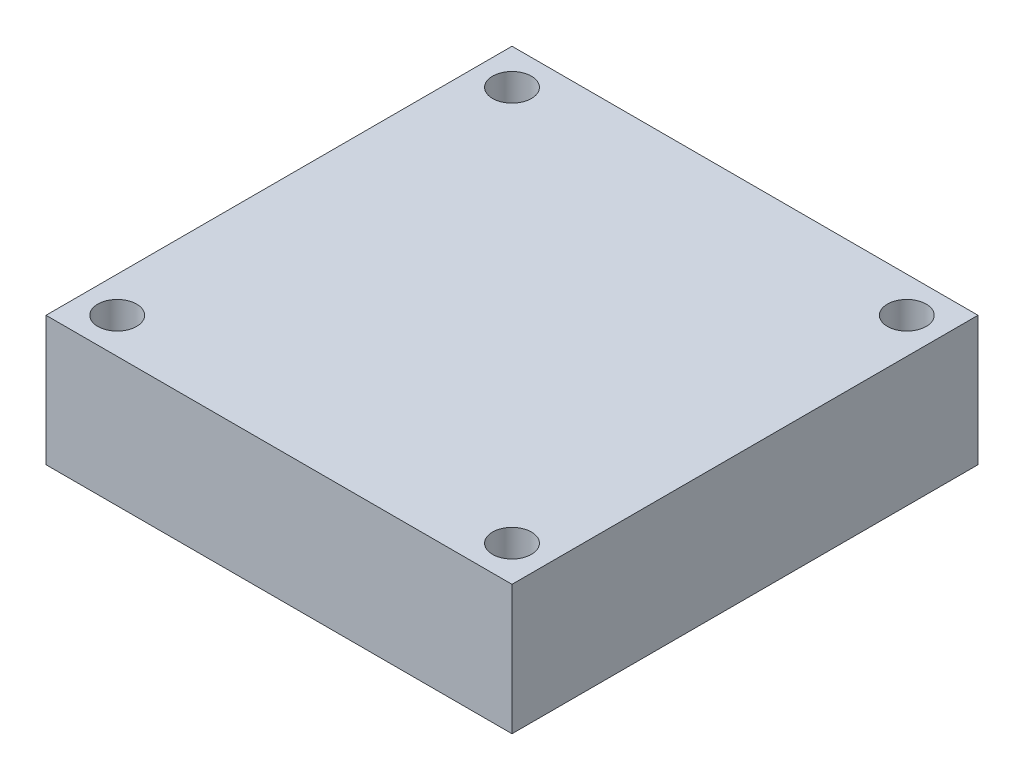
ISO-10303-21;
HEADER;
FILE_DESCRIPTION(('STEP AP214'),'2;1');
FILE_NAME('part.step','',(''),(''),'','','');
FILE_SCHEMA(('AUTOMOTIVE_DESIGN { 1 0 10303 214 1 1 1 1 }'));
ENDSEC;
DATA;
#1=APPLICATION_CONTEXT('core data for automotive mechanical design processes');
#2=APPLICATION_PROTOCOL_DEFINITION('international standard','automotive_design',2000,#1);
#3=PRODUCT_CONTEXT('',#1,'mechanical');
#4=PRODUCT('Part','Part','',(#3));
#5=PRODUCT_RELATED_PRODUCT_CATEGORY('part','',(#4));
#6=PRODUCT_DEFINITION_FORMATION('','',#4);
#7=PRODUCT_DEFINITION_CONTEXT('part definition',#1,'design');
#8=PRODUCT_DEFINITION('design','',#6,#7);
#9=PRODUCT_DEFINITION_SHAPE('','',#8);
#10=(LENGTH_UNIT() NAMED_UNIT(*) SI_UNIT(.MILLI.,.METRE.));
#11=(NAMED_UNIT(*) PLANE_ANGLE_UNIT() SI_UNIT($,.RADIAN.));
#12=(NAMED_UNIT(*) SI_UNIT($,.STERADIAN.) SOLID_ANGLE_UNIT());
#13=UNCERTAINTY_MEASURE_WITH_UNIT(LENGTH_MEASURE(1.E-05),#10,'distance_accuracy_value','');
#14=(GEOMETRIC_REPRESENTATION_CONTEXT(3) GLOBAL_UNCERTAINTY_ASSIGNED_CONTEXT((#13)) GLOBAL_UNIT_ASSIGNED_CONTEXT((#10,
#11,#12)) REPRESENTATION_CONTEXT('',''));
#15=CARTESIAN_POINT('',(0.,0.,0.));
#16=DIRECTION('',(0.,0.,1.));
#17=DIRECTION('',(1.,0.,0.));
#18=AXIS2_PLACEMENT_3D('',#15,#16,#17);
#19=CARTESIAN_POINT('',(-18.,10.,18.));
#20=DIRECTION('',(1.,0.,0.));
#21=DIRECTION('',(0.,0.,-1.));
#22=AXIS2_PLACEMENT_3D('',#19,#20,#21);
#23=PLANE('',#22);
#24=DIRECTION('',(0.,0.,1.));
#25=VECTOR('',#24,1.);
#26=CARTESIAN_POINT('',(-18.,0.,18.));
#27=LINE('',#26,#25);
#28=CARTESIAN_POINT('',(-18.,0.,-18.));
#29=VERTEX_POINT('',#28);
#30=CARTESIAN_POINT('',(-18.,0.,18.));
#31=VERTEX_POINT('',#30);
#32=EDGE_CURVE('E98',#29,#31,#27,.T.);
#33=ORIENTED_EDGE('',*,*,#32,.T.);
#34=DIRECTION('',(0.,-1.,0.));
#35=VECTOR('',#34,1.);
#36=CARTESIAN_POINT('',(-18.,10.,18.));
#37=LINE('',#36,#35);
#38=CARTESIAN_POINT('',(-18.,10.,18.));
#39=VERTEX_POINT('',#38);
#40=EDGE_CURVE('E11',#39,#31,#37,.T.);
#41=ORIENTED_EDGE('',*,*,#40,.F.);
#42=DIRECTION('',(0.,0.,1.));
#43=VECTOR('',#42,1.);
#44=CARTESIAN_POINT('',(-18.,10.,18.));
#45=LINE('',#44,#43);
#46=CARTESIAN_POINT('',(-18.,10.,-18.));
#47=VERTEX_POINT('',#46);
#48=EDGE_CURVE('E86',#47,#39,#45,.T.);
#49=ORIENTED_EDGE('',*,*,#48,.F.);
#50=DIRECTION('',(0.,-1.,0.));
#51=VECTOR('',#50,1.);
#52=CARTESIAN_POINT('',(-18.,10.,-18.));
#53=LINE('',#52,#51);
#54=EDGE_CURVE('E94',#47,#29,#53,.T.);
#55=ORIENTED_EDGE('',*,*,#54,.T.);
#56=EDGE_LOOP('',(#33,#41,#49,#55));
#57=FACE_BOUND('',#56,.T.);
#58=ADVANCED_FACE('F35',(#57),#23,.F.);
#59=CARTESIAN_POINT('',(-18.,10.,18.));
#60=DIRECTION('',(0.,0.,-1.));
#61=DIRECTION('',(-1.,0.,0.));
#62=AXIS2_PLACEMENT_3D('',#59,#60,#61);
#63=PLANE('',#62);
#64=DIRECTION('',(1.,0.,0.));
#65=VECTOR('',#64,1.);
#66=CARTESIAN_POINT('',(-18.,0.,18.));
#67=LINE('',#66,#65);
#68=CARTESIAN_POINT('',(18.,0.,18.));
#69=VERTEX_POINT('',#68);
#70=EDGE_CURVE('E90',#31,#69,#67,.T.);
#71=ORIENTED_EDGE('',*,*,#70,.T.);
#72=DIRECTION('',(0.,-1.,0.));
#73=VECTOR('',#72,1.);
#74=CARTESIAN_POINT('',(18.,10.,18.));
#75=LINE('',#74,#73);
#76=CARTESIAN_POINT('',(18.,10.,18.));
#77=VERTEX_POINT('',#76);
#78=EDGE_CURVE('E43',#77,#69,#75,.T.);
#79=ORIENTED_EDGE('',*,*,#78,.F.);
#80=DIRECTION('',(1.,0.,0.));
#81=VECTOR('',#80,1.);
#82=CARTESIAN_POINT('',(-18.,10.,18.));
#83=LINE('',#82,#81);
#84=EDGE_CURVE('E81',#39,#77,#83,.T.);
#85=ORIENTED_EDGE('',*,*,#84,.F.);
#86=ORIENTED_EDGE('',*,*,#40,.T.);
#87=EDGE_LOOP('',(#71,#79,#85,#86));
#88=FACE_BOUND('',#87,.T.);
#89=ADVANCED_FACE('F89',(#88),#63,.F.);
#90=CARTESIAN_POINT('',(18.,10.,18.));
#91=DIRECTION('',(-1.,0.,0.));
#92=DIRECTION('',(0.,0.,1.));
#93=AXIS2_PLACEMENT_3D('',#90,#91,#92);
#94=PLANE('',#93);
#95=DIRECTION('',(0.,0.,-1.));
#96=VECTOR('',#95,1.);
#97=CARTESIAN_POINT('',(18.,0.,18.));
#98=LINE('',#97,#96);
#99=CARTESIAN_POINT('',(18.,0.,-18.));
#100=VERTEX_POINT('',#99);
#101=EDGE_CURVE('E68',#69,#100,#98,.T.);
#102=ORIENTED_EDGE('',*,*,#101,.T.);
#103=DIRECTION('',(0.,-1.,0.));
#104=VECTOR('',#103,1.);
#105=CARTESIAN_POINT('',(18.,10.,-18.));
#106=LINE('',#105,#104);
#107=CARTESIAN_POINT('',(18.,10.,-18.));
#108=VERTEX_POINT('',#107);
#109=EDGE_CURVE('E91',#108,#100,#106,.T.);
#110=ORIENTED_EDGE('',*,*,#109,.F.);
#111=DIRECTION('',(0.,0.,-1.));
#112=VECTOR('',#111,1.);
#113=CARTESIAN_POINT('',(18.,10.,18.));
#114=LINE('',#113,#112);
#115=EDGE_CURVE('E84',#77,#108,#114,.T.);
#116=ORIENTED_EDGE('',*,*,#115,.F.);
#117=ORIENTED_EDGE('',*,*,#78,.T.);
#118=EDGE_LOOP('',(#102,#110,#116,#117));
#119=FACE_BOUND('',#118,.T.);
#120=ADVANCED_FACE('F92',(#119),#94,.F.);
#121=CARTESIAN_POINT('',(-18.,10.,-18.));
#122=DIRECTION('',(0.,0.,1.));
#123=DIRECTION('',(1.,0.,0.));
#124=AXIS2_PLACEMENT_3D('',#121,#122,#123);
#125=PLANE('',#124);
#126=DIRECTION('',(-1.,0.,0.));
#127=VECTOR('',#126,1.);
#128=CARTESIAN_POINT('',(-18.,0.,-18.));
#129=LINE('',#128,#127);
#130=EDGE_CURVE('E74',#100,#29,#129,.T.);
#131=ORIENTED_EDGE('',*,*,#130,.T.);
#132=ORIENTED_EDGE('',*,*,#54,.F.);
#133=DIRECTION('',(-1.,0.,0.));
#134=VECTOR('',#133,1.);
#135=CARTESIAN_POINT('',(-18.,10.,-18.));
#136=LINE('',#135,#134);
#137=EDGE_CURVE('E51',#108,#47,#136,.T.);
#138=ORIENTED_EDGE('',*,*,#137,.F.);
#139=ORIENTED_EDGE('',*,*,#109,.T.);
#140=EDGE_LOOP('',(#131,#132,#138,#139));
#141=FACE_BOUND('',#140,.T.);
#142=ADVANCED_FACE('F106',(#141),#125,.F.);
#143=CARTESIAN_POINT('',(0.,10.,0.));
#144=DIRECTION('',(0.,-1.,0.));
#145=DIRECTION('',(0.,0.,-1.));
#146=AXIS2_PLACEMENT_3D('',#143,#144,#145);
#147=PLANE('',#146);
#148=CARTESIAN_POINT('',(-15.25,10.,15.25));
#149=DIRECTION('',(0.,1.,0.));
#150=DIRECTION('',(0.,0.,1.));
#151=AXIS2_PLACEMENT_3D('',#148,#149,#150);
#152=CIRCLE('',#151,1.5);
#153=CARTESIAN_POINT('',(-15.25,10.,16.75));
#154=VERTEX_POINT('',#153);
#155=EDGE_CURVE('E118',#154,#154,#152,.T.);
#156=ORIENTED_EDGE('',*,*,#155,.F.);
#157=EDGE_LOOP('',(#156));
#158=FACE_BOUND('',#157,.T.);
#159=CARTESIAN_POINT('',(15.25,10.,15.25));
#160=DIRECTION('',(0.,1.,0.));
#161=DIRECTION('',(0.,0.,1.));
#162=AXIS2_PLACEMENT_3D('',#159,#160,#161);
#163=CIRCLE('',#162,1.5);
#164=CARTESIAN_POINT('',(15.25,10.,16.75));
#165=VERTEX_POINT('',#164);
#166=EDGE_CURVE('E124',#165,#165,#163,.T.);
#167=ORIENTED_EDGE('',*,*,#166,.F.);
#168=EDGE_LOOP('',(#167));
#169=FACE_BOUND('',#168,.T.);
#170=CARTESIAN_POINT('',(15.25,10.,-15.25));
#171=DIRECTION('',(0.,1.,0.));
#172=DIRECTION('',(0.,0.,1.));
#173=AXIS2_PLACEMENT_3D('',#170,#171,#172);
#174=CIRCLE('',#173,1.5);
#175=CARTESIAN_POINT('',(15.25,10.,-13.75));
#176=VERTEX_POINT('',#175);
#177=EDGE_CURVE('E130',#176,#176,#174,.T.);
#178=ORIENTED_EDGE('',*,*,#177,.F.);
#179=EDGE_LOOP('',(#178));
#180=FACE_BOUND('',#179,.T.);
#181=CARTESIAN_POINT('',(-15.25,10.,-15.25));
#182=DIRECTION('',(0.,1.,0.));
#183=DIRECTION('',(0.,0.,1.));
#184=AXIS2_PLACEMENT_3D('',#181,#182,#183);
#185=CIRCLE('',#184,1.5);
#186=CARTESIAN_POINT('',(-15.25,10.,-13.75));
#187=VERTEX_POINT('',#186);
#188=EDGE_CURVE('E112',#187,#187,#185,.T.);
#189=ORIENTED_EDGE('',*,*,#188,.F.);
#190=EDGE_LOOP('',(#189));
#191=FACE_BOUND('',#190,.T.);
#192=ORIENTED_EDGE('',*,*,#48,.T.);
#193=ORIENTED_EDGE('',*,*,#84,.T.);
#194=ORIENTED_EDGE('',*,*,#115,.T.);
#195=ORIENTED_EDGE('',*,*,#137,.T.);
#196=EDGE_LOOP('',(#192,#193,#194,#195));
#197=FACE_BOUND('',#196,.T.);
#198=ADVANCED_FACE('F82',(#158,#169,#180,#191,#197),#147,.F.);
#199=CARTESIAN_POINT('',(0.,0.,0.));
#200=DIRECTION('',(0.,-1.,0.));
#201=DIRECTION('',(0.,0.,-1.));
#202=AXIS2_PLACEMENT_3D('',#199,#200,#201);
#203=PLANE('',#202);
#204=CARTESIAN_POINT('',(-15.25,0.,15.25));
#205=DIRECTION('',(0.,1.,0.));
#206=DIRECTION('',(0.,0.,1.));
#207=AXIS2_PLACEMENT_3D('',#204,#205,#206);
#208=CIRCLE('',#207,1.5);
#209=CARTESIAN_POINT('',(-15.25,0.,16.75));
#210=VERTEX_POINT('',#209);
#211=EDGE_CURVE('E121',#210,#210,#208,.T.);
#212=ORIENTED_EDGE('',*,*,#211,.T.);
#213=EDGE_LOOP('',(#212));
#214=FACE_BOUND('',#213,.T.);
#215=CARTESIAN_POINT('',(15.25,0.,15.25));
#216=DIRECTION('',(0.,1.,0.));
#217=DIRECTION('',(0.,0.,1.));
#218=AXIS2_PLACEMENT_3D('',#215,#216,#217);
#219=CIRCLE('',#218,1.5);
#220=CARTESIAN_POINT('',(15.25,0.,16.75));
#221=VERTEX_POINT('',#220);
#222=EDGE_CURVE('E127',#221,#221,#219,.T.);
#223=ORIENTED_EDGE('',*,*,#222,.T.);
#224=EDGE_LOOP('',(#223));
#225=FACE_BOUND('',#224,.T.);
#226=CARTESIAN_POINT('',(15.25,0.,-15.25));
#227=DIRECTION('',(0.,1.,0.));
#228=DIRECTION('',(0.,0.,1.));
#229=AXIS2_PLACEMENT_3D('',#226,#227,#228);
#230=CIRCLE('',#229,1.5);
#231=CARTESIAN_POINT('',(15.25,0.,-13.75));
#232=VERTEX_POINT('',#231);
#233=EDGE_CURVE('E115',#232,#232,#230,.T.);
#234=ORIENTED_EDGE('',*,*,#233,.T.);
#235=EDGE_LOOP('',(#234));
#236=FACE_BOUND('',#235,.T.);
#237=CARTESIAN_POINT('',(-15.25,0.,-15.25));
#238=DIRECTION('',(0.,1.,0.));
#239=DIRECTION('',(0.,0.,1.));
#240=AXIS2_PLACEMENT_3D('',#237,#238,#239);
#241=CIRCLE('',#240,1.5);
#242=CARTESIAN_POINT('',(-15.25,0.,-13.75));
#243=VERTEX_POINT('',#242);
#244=EDGE_CURVE('E101',#243,#243,#241,.T.);
#245=ORIENTED_EDGE('',*,*,#244,.T.);
#246=EDGE_LOOP('',(#245));
#247=FACE_BOUND('',#246,.T.);
#248=ORIENTED_EDGE('',*,*,#32,.F.);
#249=ORIENTED_EDGE('',*,*,#130,.F.);
#250=ORIENTED_EDGE('',*,*,#101,.F.);
#251=ORIENTED_EDGE('',*,*,#70,.F.);
#252=EDGE_LOOP('',(#248,#249,#250,#251));
#253=FACE_BOUND('',#252,.T.);
#254=ADVANCED_FACE('F109',(#214,#225,#236,#247,#253),#203,.T.);
#255=CARTESIAN_POINT('',(-15.25,0.,-15.25));
#256=DIRECTION('',(0.,1.,0.));
#257=DIRECTION('',(0.,0.,1.));
#258=AXIS2_PLACEMENT_3D('',#255,#256,#257);
#259=CYLINDRICAL_SURFACE('',#258,1.5);
#260=ORIENTED_EDGE('',*,*,#244,.F.);
#261=EDGE_LOOP('',(#260));
#262=FACE_BOUND('',#261,.T.);
#263=ORIENTED_EDGE('',*,*,#188,.T.);
#264=EDGE_LOOP('',(#263));
#265=FACE_BOUND('',#264,.T.);
#266=ADVANCED_FACE('F142',(#262,#265),#259,.F.);
#267=CARTESIAN_POINT('',(15.25,0.,-15.25));
#268=DIRECTION('',(0.,1.,0.));
#269=DIRECTION('',(0.,0.,1.));
#270=AXIS2_PLACEMENT_3D('',#267,#268,#269);
#271=CYLINDRICAL_SURFACE('',#270,1.5);
#272=ORIENTED_EDGE('',*,*,#233,.F.);
#273=EDGE_LOOP('',(#272));
#274=FACE_BOUND('',#273,.T.);
#275=ORIENTED_EDGE('',*,*,#177,.T.);
#276=EDGE_LOOP('',(#275));
#277=FACE_BOUND('',#276,.T.);
#278=ADVANCED_FACE('F138',(#274,#277),#271,.F.);
#279=CARTESIAN_POINT('',(15.25,0.,15.25));
#280=DIRECTION('',(0.,1.,0.));
#281=DIRECTION('',(0.,0.,1.));
#282=AXIS2_PLACEMENT_3D('',#279,#280,#281);
#283=CYLINDRICAL_SURFACE('',#282,1.5);
#284=ORIENTED_EDGE('',*,*,#222,.F.);
#285=EDGE_LOOP('',(#284));
#286=FACE_BOUND('',#285,.T.);
#287=ORIENTED_EDGE('',*,*,#166,.T.);
#288=EDGE_LOOP('',(#287));
#289=FACE_BOUND('',#288,.T.);
#290=ADVANCED_FACE('F141',(#286,#289),#283,.F.);
#291=CARTESIAN_POINT('',(-15.25,0.,15.25));
#292=DIRECTION('',(0.,1.,0.));
#293=DIRECTION('',(0.,0.,1.));
#294=AXIS2_PLACEMENT_3D('',#291,#292,#293);
#295=CYLINDRICAL_SURFACE('',#294,1.5);
#296=ORIENTED_EDGE('',*,*,#211,.F.);
#297=EDGE_LOOP('',(#296));
#298=FACE_BOUND('',#297,.T.);
#299=ORIENTED_EDGE('',*,*,#155,.T.);
#300=EDGE_LOOP('',(#299));
#301=FACE_BOUND('',#300,.T.);
#302=ADVANCED_FACE('F205',(#298,#301),#295,.F.);
#303=CLOSED_SHELL('',(#58,#89,#120,#142,#198,#254,#266,#278,#290,#302));
#304=MANIFOLD_SOLID_BREP('B2',#303);
#305=ADVANCED_BREP_SHAPE_REPRESENTATION('',(#18,#304),#14);
#306=SHAPE_DEFINITION_REPRESENTATION(#9,#305);
ENDSEC;
END-ISO-10303-21;
